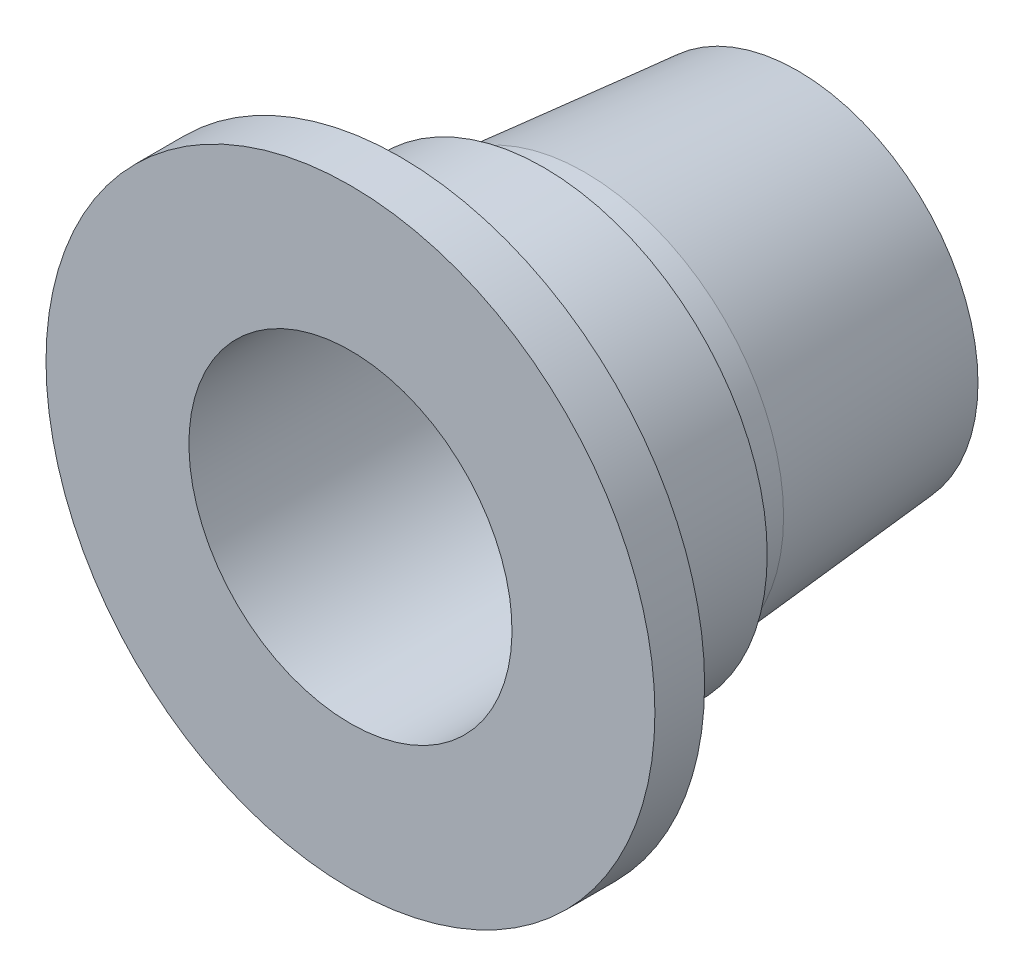
ISO-10303-21;
HEADER;
FILE_DESCRIPTION(('STEP AP214'),'2;1');
FILE_NAME('part.step','',(''),(''),'','','');
FILE_SCHEMA(('AUTOMOTIVE_DESIGN { 1 0 10303 214 1 1 1 1 }'));
ENDSEC;
DATA;
#1=APPLICATION_CONTEXT('core data for automotive mechanical design processes');
#2=APPLICATION_PROTOCOL_DEFINITION('international standard','automotive_design',2000,#1);
#3=PRODUCT_CONTEXT('',#1,'mechanical');
#4=PRODUCT('Part','Part','',(#3));
#5=PRODUCT_RELATED_PRODUCT_CATEGORY('part','',(#4));
#6=PRODUCT_DEFINITION_FORMATION('','',#4);
#7=PRODUCT_DEFINITION_CONTEXT('part definition',#1,'design');
#8=PRODUCT_DEFINITION('design','',#6,#7);
#9=PRODUCT_DEFINITION_SHAPE('','',#8);
#10=(LENGTH_UNIT() NAMED_UNIT(*) SI_UNIT(.MILLI.,.METRE.));
#11=(NAMED_UNIT(*) PLANE_ANGLE_UNIT() SI_UNIT($,.RADIAN.));
#12=(NAMED_UNIT(*) SI_UNIT($,.STERADIAN.) SOLID_ANGLE_UNIT());
#13=UNCERTAINTY_MEASURE_WITH_UNIT(LENGTH_MEASURE(1.E-05),#10,'distance_accuracy_value','');
#14=(GEOMETRIC_REPRESENTATION_CONTEXT(3) GLOBAL_UNCERTAINTY_ASSIGNED_CONTEXT((#13)) GLOBAL_UNIT_ASSIGNED_CONTEXT((#10,
#11,#12)) REPRESENTATION_CONTEXT('',''));
#15=CARTESIAN_POINT('',(0.,0.,0.));
#16=DIRECTION('',(0.,0.,1.));
#17=DIRECTION('',(1.,0.,0.));
#18=AXIS2_PLACEMENT_3D('',#15,#16,#17);
#19=CARTESIAN_POINT('',(0.,24.5,0.));
#20=DIRECTION('',(0.,0.,-1.));
#21=DIRECTION('',(0.,1.,0.));
#22=AXIS2_PLACEMENT_3D('',#19,#20,#21);
#23=PLANE('',#22);
#24=CARTESIAN_POINT('',(0.,0.,0.));
#25=DIRECTION('',(0.,0.,1.));
#26=DIRECTION('',(0.,-1.,0.));
#27=AXIS2_PLACEMENT_3D('',#24,#25,#26);
#28=CIRCLE('',#27,13.);
#29=CARTESIAN_POINT('',(0.,-13.,0.));
#30=VERTEX_POINT('',#29);
#31=EDGE_CURVE('E49',#30,#30,#28,.T.);
#32=ORIENTED_EDGE('',*,*,#31,.F.);
#33=EDGE_LOOP('',(#32));
#34=FACE_BOUND('',#33,.T.);
#35=CARTESIAN_POINT('',(0.,0.,0.));
#36=DIRECTION('',(0.,0.,1.));
#37=DIRECTION('',(0.,-1.,0.));
#38=AXIS2_PLACEMENT_3D('',#35,#36,#37);
#39=CIRCLE('',#38,24.5);
#40=CARTESIAN_POINT('',(0.,-24.5,0.));
#41=VERTEX_POINT('',#40);
#42=EDGE_CURVE('E73',#41,#41,#39,.T.);
#43=ORIENTED_EDGE('',*,*,#42,.T.);
#44=EDGE_LOOP('',(#43));
#45=FACE_BOUND('',#44,.T.);
#46=ADVANCED_FACE('F29',(#34,#45),#23,.F.);
#47=CARTESIAN_POINT('',(0.,0.,0.));
#48=DIRECTION('',(0.,0.,1.));
#49=DIRECTION('',(0.,-1.,0.));
#50=AXIS2_PLACEMENT_3D('',#47,#48,#49);
#51=CYLINDRICAL_SURFACE('',#50,13.);
#52=CARTESIAN_POINT('',(0.,0.,-36.));
#53=DIRECTION('',(0.,0.,1.));
#54=DIRECTION('',(0.,-1.,0.));
#55=AXIS2_PLACEMENT_3D('',#52,#53,#54);
#56=CIRCLE('',#55,13.);
#57=CARTESIAN_POINT('',(0.,-13.,-36.));
#58=VERTEX_POINT('',#57);
#59=EDGE_CURVE('E52',#58,#58,#56,.T.);
#60=ORIENTED_EDGE('',*,*,#59,.F.);
#61=EDGE_LOOP('',(#60));
#62=FACE_BOUND('',#61,.T.);
#63=ORIENTED_EDGE('',*,*,#31,.T.);
#64=EDGE_LOOP('',(#63));
#65=FACE_BOUND('',#64,.T.);
#66=ADVANCED_FACE('F108',(#62,#65),#51,.F.);
#67=CARTESIAN_POINT('',(0.,13.,-36.));
#68=DIRECTION('',(0.,0.,1.));
#69=DIRECTION('',(0.,-1.,0.));
#70=AXIS2_PLACEMENT_3D('',#67,#68,#69);
#71=PLANE('',#70);
#72=CARTESIAN_POINT('',(0.,0.,-36.));
#73=DIRECTION('',(0.,0.,1.));
#74=DIRECTION('',(0.,-1.,0.));
#75=AXIS2_PLACEMENT_3D('',#72,#73,#74);
#76=CIRCLE('',#75,14.5);
#77=CARTESIAN_POINT('',(0.,-14.5,-36.));
#78=VERTEX_POINT('',#77);
#79=EDGE_CURVE('E55',#78,#78,#76,.T.);
#80=ORIENTED_EDGE('',*,*,#79,.F.);
#81=EDGE_LOOP('',(#80));
#82=FACE_BOUND('',#81,.T.);
#83=ORIENTED_EDGE('',*,*,#59,.T.);
#84=EDGE_LOOP('',(#83));
#85=FACE_BOUND('',#84,.T.);
#86=ADVANCED_FACE('F114',(#82,#85),#71,.F.);
#87=CARTESIAN_POINT('',(0.,0.,-36.));
#88=DIRECTION('',(0.,0.,1.));
#89=DIRECTION('',(0.,-1.,0.));
#90=AXIS2_PLACEMENT_3D('',#87,#88,#89);
#91=CONICAL_SURFACE('',#90,14.5,0.0872664625997097);
#92=CARTESIAN_POINT('',(0.,0.,-18.8549215458566));
#93=DIRECTION('',(0.,0.,1.));
#94=DIRECTION('',(0.,-1.,0.));
#95=AXIS2_PLACEMENT_3D('',#92,#93,#94);
#96=CIRCLE('',#95,16.);
#97=CARTESIAN_POINT('',(0.,-16.,-18.8549215458567));
#98=VERTEX_POINT('',#97);
#99=EDGE_CURVE('E58',#98,#98,#96,.T.);
#100=ORIENTED_EDGE('',*,*,#99,.F.);
#101=EDGE_LOOP('',(#100));
#102=FACE_BOUND('',#101,.T.);
#103=ORIENTED_EDGE('',*,*,#79,.T.);
#104=EDGE_LOOP('',(#103));
#105=FACE_BOUND('',#104,.T.);
#106=ADVANCED_FACE('F182',(#102,#105),#91,.T.);
#107=CARTESIAN_POINT('',(0.,0.,0.));
#108=DIRECTION('',(0.,0.,1.));
#109=DIRECTION('',(0.,-1.,0.));
#110=AXIS2_PLACEMENT_3D('',#107,#108,#109);
#111=CYLINDRICAL_SURFACE('',#110,16.);
#112=CARTESIAN_POINT('',(0.,0.,-16.));
#113=DIRECTION('',(0.,0.,1.));
#114=DIRECTION('',(0.,-1.,0.));
#115=AXIS2_PLACEMENT_3D('',#112,#113,#114);
#116=CIRCLE('',#115,16.);
#117=CARTESIAN_POINT('',(0.,-16.,-16.));
#118=VERTEX_POINT('',#117);
#119=EDGE_CURVE('E61',#118,#118,#116,.T.);
#120=ORIENTED_EDGE('',*,*,#119,.F.);
#121=EDGE_LOOP('',(#120));
#122=FACE_BOUND('',#121,.T.);
#123=ORIENTED_EDGE('',*,*,#99,.T.);
#124=EDGE_LOOP('',(#123));
#125=FACE_BOUND('',#124,.T.);
#126=ADVANCED_FACE('F157',(#122,#125),#111,.T.);
#127=CARTESIAN_POINT('',(0.,16.,-16.));
#128=DIRECTION('',(0.,0.,1.));
#129=DIRECTION('',(0.,-1.,0.));
#130=AXIS2_PLACEMENT_3D('',#127,#128,#129);
#131=PLANE('',#130);
#132=CARTESIAN_POINT('',(0.,0.,-16.));
#133=DIRECTION('',(0.,0.,1.));
#134=DIRECTION('',(0.,-1.,0.));
#135=AXIS2_PLACEMENT_3D('',#132,#133,#134);
#136=CIRCLE('',#135,17.2);
#137=CARTESIAN_POINT('',(0.,-17.2,-16.));
#138=VERTEX_POINT('',#137);
#139=EDGE_CURVE('E36',#138,#138,#136,.F.);
#140=ORIENTED_EDGE('',*,*,#139,.T.);
#141=EDGE_LOOP('',(#140));
#142=FACE_BOUND('',#141,.T.);
#143=ORIENTED_EDGE('',*,*,#119,.T.);
#144=EDGE_LOOP('',(#143));
#145=FACE_BOUND('',#144,.T.);
#146=ADVANCED_FACE('F104',(#142,#145),#131,.F.);
#147=CARTESIAN_POINT('',(0.,0.,0.));
#148=DIRECTION('',(0.,0.,1.));
#149=DIRECTION('',(0.,-1.,0.));
#150=AXIS2_PLACEMENT_3D('',#147,#148,#149);
#151=CYLINDRICAL_SURFACE('',#150,18.);
#152=CARTESIAN_POINT('',(0.,0.,-15.5381197846483));
#153=DIRECTION('',(0.,0.,1.));
#154=DIRECTION('',(0.,-1.,0.));
#155=AXIS2_PLACEMENT_3D('',#152,#153,#154);
#156=CIRCLE('',#155,18.);
#157=CARTESIAN_POINT('',(0.,-18.,-15.5381197846483));
#158=VERTEX_POINT('',#157);
#159=EDGE_CURVE('E40',#158,#158,#156,.T.);
#160=ORIENTED_EDGE('',*,*,#159,.T.);
#161=EDGE_LOOP('',(#160));
#162=FACE_BOUND('',#161,.T.);
#163=CARTESIAN_POINT('',(0.,0.,-7.46188021535171));
#164=DIRECTION('',(0.,0.,-1.));
#165=DIRECTION('',(0.,1.,0.));
#166=AXIS2_PLACEMENT_3D('',#163,#164,#165);
#167=CIRCLE('',#166,18.);
#168=CARTESIAN_POINT('',(0.,18.,-7.46188021535171));
#169=VERTEX_POINT('',#168);
#170=EDGE_CURVE('E44',#169,#169,#167,.T.);
#171=ORIENTED_EDGE('',*,*,#170,.T.);
#172=EDGE_LOOP('',(#171));
#173=FACE_BOUND('',#172,.T.);
#174=ADVANCED_FACE('F99',(#162,#173),#151,.T.);
#175=CARTESIAN_POINT('',(0.,18.,-7.));
#176=DIRECTION('',(0.,0.,-1.));
#177=DIRECTION('',(0.,1.,0.));
#178=AXIS2_PLACEMENT_3D('',#175,#176,#177);
#179=PLANE('',#178);
#180=CARTESIAN_POINT('',(0.,0.,-7.00000000000001));
#181=DIRECTION('',(0.,0.,-1.));
#182=DIRECTION('',(0.,1.,0.));
#183=AXIS2_PLACEMENT_3D('',#180,#181,#182);
#184=CIRCLE('',#183,17.2);
#185=CARTESIAN_POINT('',(0.,17.2,-7.));
#186=VERTEX_POINT('',#185);
#187=EDGE_CURVE('E10',#186,#186,#184,.F.);
#188=ORIENTED_EDGE('',*,*,#187,.T.);
#189=EDGE_LOOP('',(#188));
#190=FACE_BOUND('',#189,.T.);
#191=CARTESIAN_POINT('',(0.,0.,-7.00000000000001));
#192=DIRECTION('',(0.,0.,1.));
#193=DIRECTION('',(0.,-1.,0.));
#194=AXIS2_PLACEMENT_3D('',#191,#192,#193);
#195=CIRCLE('',#194,16.);
#196=CARTESIAN_POINT('',(0.,-16.,-7.00000000000001));
#197=VERTEX_POINT('',#196);
#198=EDGE_CURVE('E64',#197,#197,#195,.T.);
#199=ORIENTED_EDGE('',*,*,#198,.F.);
#200=EDGE_LOOP('',(#199));
#201=FACE_BOUND('',#200,.T.);
#202=ADVANCED_FACE('F94',(#190,#201),#179,.F.);
#203=CARTESIAN_POINT('',(0.,0.,0.));
#204=DIRECTION('',(0.,0.,1.));
#205=DIRECTION('',(0.,-1.,0.));
#206=AXIS2_PLACEMENT_3D('',#203,#204,#205);
#207=CYLINDRICAL_SURFACE('',#206,16.);
#208=CARTESIAN_POINT('',(0.,0.,-4.00000000000001));
#209=DIRECTION('',(0.,0.,1.));
#210=DIRECTION('',(0.,-1.,0.));
#211=AXIS2_PLACEMENT_3D('',#208,#209,#210);
#212=CIRCLE('',#211,16.);
#213=CARTESIAN_POINT('',(0.,-16.,-4.00000000000001));
#214=VERTEX_POINT('',#213);
#215=EDGE_CURVE('E67',#214,#214,#212,.T.);
#216=ORIENTED_EDGE('',*,*,#215,.F.);
#217=EDGE_LOOP('',(#216));
#218=FACE_BOUND('',#217,.T.);
#219=ORIENTED_EDGE('',*,*,#198,.T.);
#220=EDGE_LOOP('',(#219));
#221=FACE_BOUND('',#220,.T.);
#222=ADVANCED_FACE('F88',(#218,#221),#207,.T.);
#223=CARTESIAN_POINT('',(0.,16.,-4.));
#224=DIRECTION('',(0.,0.,1.));
#225=DIRECTION('',(0.,-1.,0.));
#226=AXIS2_PLACEMENT_3D('',#223,#224,#225);
#227=PLANE('',#226);
#228=CARTESIAN_POINT('',(0.,0.,-4.00000000000001));
#229=DIRECTION('',(0.,0.,1.));
#230=DIRECTION('',(0.,-1.,0.));
#231=AXIS2_PLACEMENT_3D('',#228,#229,#230);
#232=CIRCLE('',#231,24.5);
#233=CARTESIAN_POINT('',(0.,-24.5,-4.00000000000001));
#234=VERTEX_POINT('',#233);
#235=EDGE_CURVE('E70',#234,#234,#232,.T.);
#236=ORIENTED_EDGE('',*,*,#235,.F.);
#237=EDGE_LOOP('',(#236));
#238=FACE_BOUND('',#237,.T.);
#239=ORIENTED_EDGE('',*,*,#215,.T.);
#240=EDGE_LOOP('',(#239));
#241=FACE_BOUND('',#240,.T.);
#242=ADVANCED_FACE('F82',(#238,#241),#227,.F.);
#243=CARTESIAN_POINT('',(0.,0.,0.));
#244=DIRECTION('',(0.,0.,1.));
#245=DIRECTION('',(0.,-1.,0.));
#246=AXIS2_PLACEMENT_3D('',#243,#244,#245);
#247=CYLINDRICAL_SURFACE('',#246,24.5);
#248=ORIENTED_EDGE('',*,*,#42,.F.);
#249=EDGE_LOOP('',(#248));
#250=FACE_BOUND('',#249,.T.);
#251=ORIENTED_EDGE('',*,*,#235,.T.);
#252=EDGE_LOOP('',(#251));
#253=FACE_BOUND('',#252,.T.);
#254=ADVANCED_FACE('F78',(#250,#253),#247,.T.);
#255=CARTESIAN_POINT('',(0.,0.,-15.5381197846483));
#256=DIRECTION('',(0.,0.,1.));
#257=DIRECTION('',(0.,-1.,0.));
#258=AXIS2_PLACEMENT_3D('',#255,#256,#257);
#259=CONICAL_SURFACE('',#258,18.,1.0471975511966);
#260=ORIENTED_EDGE('',*,*,#139,.F.);
#261=EDGE_LOOP('',(#260));
#262=FACE_BOUND('',#261,.T.);
#263=ORIENTED_EDGE('',*,*,#159,.F.);
#264=EDGE_LOOP('',(#263));
#265=FACE_BOUND('',#264,.T.);
#266=ADVANCED_FACE('F81',(#262,#265),#259,.T.);
#267=CARTESIAN_POINT('',(0.,0.,-7.00000000000001));
#268=DIRECTION('',(0.,0.,-1.));
#269=DIRECTION('',(0.,1.,0.));
#270=AXIS2_PLACEMENT_3D('',#267,#268,#269);
#271=CONICAL_SURFACE('',#270,17.2,1.0471975511966);
#272=ORIENTED_EDGE('',*,*,#170,.F.);
#273=EDGE_LOOP('',(#272));
#274=FACE_BOUND('',#273,.T.);
#275=ORIENTED_EDGE('',*,*,#187,.F.);
#276=EDGE_LOOP('',(#275));
#277=FACE_BOUND('',#276,.T.);
#278=ADVANCED_FACE('F31',(#274,#277),#271,.T.);
#279=CLOSED_SHELL('',(#46,#66,#86,#106,#126,#146,#174,#202,#222,#242,#254,#266,#278));
#280=MANIFOLD_SOLID_BREP('B2',#279);
#281=ADVANCED_BREP_SHAPE_REPRESENTATION('',(#18,#280),#14);
#282=SHAPE_DEFINITION_REPRESENTATION(#9,#281);
ENDSEC;
END-ISO-10303-21;
